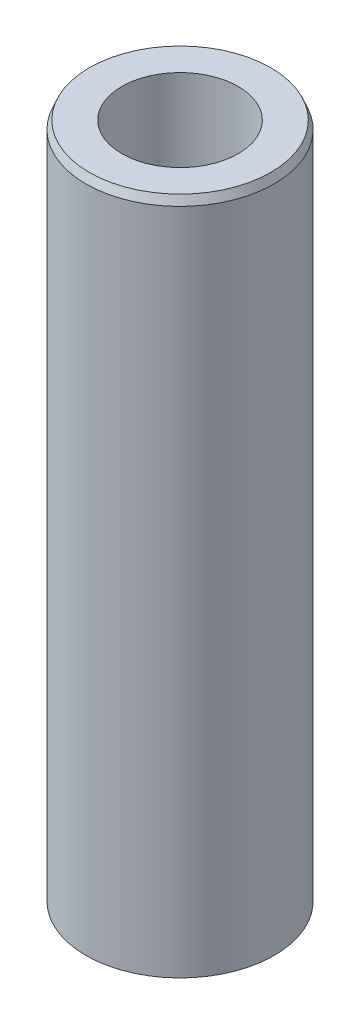
ISO-10303-21;
HEADER;
FILE_DESCRIPTION(('STEP AP214'),'2;1');
FILE_NAME('part.step','',(''),(''),'','','');
FILE_SCHEMA(('AUTOMOTIVE_DESIGN { 1 0 10303 214 1 1 1 1 }'));
ENDSEC;
DATA;
#1=APPLICATION_CONTEXT('core data for automotive mechanical design processes');
#2=APPLICATION_PROTOCOL_DEFINITION('international standard','automotive_design',2000,#1);
#3=PRODUCT_CONTEXT('',#1,'mechanical');
#4=PRODUCT('Part','Part','',(#3));
#5=PRODUCT_RELATED_PRODUCT_CATEGORY('part','',(#4));
#6=PRODUCT_DEFINITION_FORMATION('','',#4);
#7=PRODUCT_DEFINITION_CONTEXT('part definition',#1,'design');
#8=PRODUCT_DEFINITION('design','',#6,#7);
#9=PRODUCT_DEFINITION_SHAPE('','',#8);
#10=(LENGTH_UNIT() NAMED_UNIT(*) SI_UNIT(.MILLI.,.METRE.));
#11=(NAMED_UNIT(*) PLANE_ANGLE_UNIT() SI_UNIT($,.RADIAN.));
#12=(NAMED_UNIT(*) SI_UNIT($,.STERADIAN.) SOLID_ANGLE_UNIT());
#13=UNCERTAINTY_MEASURE_WITH_UNIT(LENGTH_MEASURE(1.E-05),#10,'distance_accuracy_value','');
#14=(GEOMETRIC_REPRESENTATION_CONTEXT(3) GLOBAL_UNCERTAINTY_ASSIGNED_CONTEXT((#13)) GLOBAL_UNIT_ASSIGNED_CONTEXT((#10,
#11,#12)) REPRESENTATION_CONTEXT('',''));
#15=CARTESIAN_POINT('',(0.,0.,0.));
#16=DIRECTION('',(0.,0.,1.));
#17=DIRECTION('',(1.,0.,0.));
#18=AXIS2_PLACEMENT_3D('',#15,#16,#17);
#19=CARTESIAN_POINT('',(0.,288.856588815839,0.));
#20=DIRECTION('',(0.,-1.,0.));
#21=DIRECTION('',(0.,0.,-1.));
#22=AXIS2_PLACEMENT_3D('',#19,#20,#21);
#23=CYLINDRICAL_SURFACE('',#22,40.);
#24=CARTESIAN_POINT('',(0.,285.353892137716,0.));
#25=DIRECTION('',(0.,1.,0.));
#26=DIRECTION('',(0.,0.,1.));
#27=AXIS2_PLACEMENT_3D('',#24,#25,#26);
#28=CIRCLE('',#27,40.);
#29=CARTESIAN_POINT('',(0.,285.353892137716,40.));
#30=VERTEX_POINT('',#29);
#31=EDGE_CURVE('E50',#30,#30,#28,.F.);
#32=ORIENTED_EDGE('',*,*,#31,.T.);
#33=EDGE_LOOP('',(#32));
#34=FACE_BOUND('',#33,.T.);
#35=CARTESIAN_POINT('',(0.,1.45416801145998,0.));
#36=DIRECTION('',(0.,1.,0.));
#37=DIRECTION('',(0.,0.,1.));
#38=AXIS2_PLACEMENT_3D('',#35,#36,#37);
#39=CIRCLE('',#38,40.);
#40=CARTESIAN_POINT('',(0.,1.45416801145998,40.));
#41=VERTEX_POINT('',#40);
#42=EDGE_CURVE('E51',#41,#41,#39,.T.);
#43=ORIENTED_EDGE('',*,*,#42,.T.);
#44=EDGE_LOOP('',(#43));
#45=FACE_BOUND('',#44,.T.);
#46=ADVANCED_FACE('F39',(#34,#45),#23,.T.);
#47=CARTESIAN_POINT('',(0.,288.856588815839,0.));
#48=DIRECTION('',(0.,1.,0.));
#49=DIRECTION('',(0.,0.,1.));
#50=AXIS2_PLACEMENT_3D('',#47,#48,#49);
#51=PLANE('',#50);
#52=CARTESIAN_POINT('',(0.,288.856588815839,0.));
#53=DIRECTION('',(0.,1.,0.));
#54=DIRECTION('',(0.,0.,1.));
#55=AXIS2_PLACEMENT_3D('',#52,#53,#54);
#56=CIRCLE('',#55,38.54583198854);
#57=CARTESIAN_POINT('',(0.,288.856588815839,38.54583198854));
#58=VERTEX_POINT('',#57);
#59=EDGE_CURVE('E54',#58,#58,#56,.T.);
#60=ORIENTED_EDGE('',*,*,#59,.T.);
#61=EDGE_LOOP('',(#60));
#62=FACE_BOUND('',#61,.T.);
#63=CARTESIAN_POINT('',(0.,288.856588815839,0.));
#64=DIRECTION('',(0.,1.,0.));
#65=DIRECTION('',(0.,0.,1.));
#66=AXIS2_PLACEMENT_3D('',#63,#64,#65);
#67=CIRCLE('',#66,24.7431589419541);
#68=CARTESIAN_POINT('',(0.,288.856588815839,24.7431589419541));
#69=VERTEX_POINT('',#68);
#70=EDGE_CURVE('E58',#69,#69,#67,.T.);
#71=ORIENTED_EDGE('',*,*,#70,.F.);
#72=EDGE_LOOP('',(#71));
#73=FACE_BOUND('',#72,.T.);
#74=ADVANCED_FACE('F69',(#62,#73),#51,.T.);
#75=CARTESIAN_POINT('',(0.,0.,0.));
#76=DIRECTION('',(0.,1.,0.));
#77=DIRECTION('',(0.,0.,1.));
#78=AXIS2_PLACEMENT_3D('',#75,#76,#77);
#79=PLANE('',#78);
#80=CARTESIAN_POINT('',(0.,0.,0.));
#81=DIRECTION('',(0.,1.,0.));
#82=DIRECTION('',(0.,0.,1.));
#83=AXIS2_PLACEMENT_3D('',#80,#81,#82);
#84=CIRCLE('',#83,36.4973033218769);
#85=CARTESIAN_POINT('',(0.,0.,36.4973033218769));
#86=VERTEX_POINT('',#85);
#87=EDGE_CURVE('E10',#86,#86,#84,.F.);
#88=ORIENTED_EDGE('',*,*,#87,.T.);
#89=EDGE_LOOP('',(#88));
#90=FACE_BOUND('',#89,.T.);
#91=CARTESIAN_POINT('',(0.,0.,0.));
#92=DIRECTION('',(0.,1.,0.));
#93=DIRECTION('',(0.,0.,1.));
#94=AXIS2_PLACEMENT_3D('',#91,#92,#93);
#95=CIRCLE('',#94,24.7431589419541);
#96=CARTESIAN_POINT('',(0.,0.,24.7431589419541));
#97=VERTEX_POINT('',#96);
#98=EDGE_CURVE('E63',#97,#97,#95,.T.);
#99=ORIENTED_EDGE('',*,*,#98,.T.);
#100=EDGE_LOOP('',(#99));
#101=FACE_BOUND('',#100,.T.);
#102=ADVANCED_FACE('F75',(#90,#101),#79,.F.);
#103=CARTESIAN_POINT('',(0.,288.856588815839,0.));
#104=DIRECTION('',(0.,-1.,0.));
#105=DIRECTION('',(0.,0.,-1.));
#106=AXIS2_PLACEMENT_3D('',#103,#104,#105);
#107=CYLINDRICAL_SURFACE('',#106,24.7431589419541);
#108=ORIENTED_EDGE('',*,*,#70,.T.);
#109=EDGE_LOOP('',(#108));
#110=FACE_BOUND('',#109,.T.);
#111=ORIENTED_EDGE('',*,*,#98,.F.);
#112=EDGE_LOOP('',(#111));
#113=FACE_BOUND('',#112,.T.);
#114=ADVANCED_FACE('F70',(#110,#113),#107,.F.);
#115=CARTESIAN_POINT('',(0.,288.856588815839,0.));
#116=DIRECTION('',(0.,-1.,0.));
#117=DIRECTION('',(0.,0.,-1.));
#118=AXIS2_PLACEMENT_3D('',#115,#116,#117);
#119=CONICAL_SURFACE('',#118,38.54583198854,0.393503835754954);
#120=ORIENTED_EDGE('',*,*,#31,.F.);
#121=EDGE_LOOP('',(#120));
#122=FACE_BOUND('',#121,.T.);
#123=ORIENTED_EDGE('',*,*,#59,.F.);
#124=EDGE_LOOP('',(#123));
#125=FACE_BOUND('',#124,.T.);
#126=ADVANCED_FACE('F81',(#122,#125),#119,.T.);
#127=CARTESIAN_POINT('',(0.,1.45416801145998,0.));
#128=DIRECTION('',(0.,1.,0.));
#129=DIRECTION('',(0.,0.,1.));
#130=AXIS2_PLACEMENT_3D('',#127,#128,#129);
#131=CONICAL_SURFACE('',#130,40.,1.17729249103994);
#132=ORIENTED_EDGE('',*,*,#87,.F.);
#133=EDGE_LOOP('',(#132));
#134=FACE_BOUND('',#133,.T.);
#135=ORIENTED_EDGE('',*,*,#42,.F.);
#136=EDGE_LOOP('',(#135));
#137=FACE_BOUND('',#136,.T.);
#138=ADVANCED_FACE('F45',(#134,#137),#131,.T.);
#139=CLOSED_SHELL('',(#46,#74,#102,#114,#126,#138));
#140=MANIFOLD_SOLID_BREP('B2',#139);
#141=ADVANCED_BREP_SHAPE_REPRESENTATION('',(#18,#140),#14);
#142=SHAPE_DEFINITION_REPRESENTATION(#9,#141);
ENDSEC;
END-ISO-10303-21;
